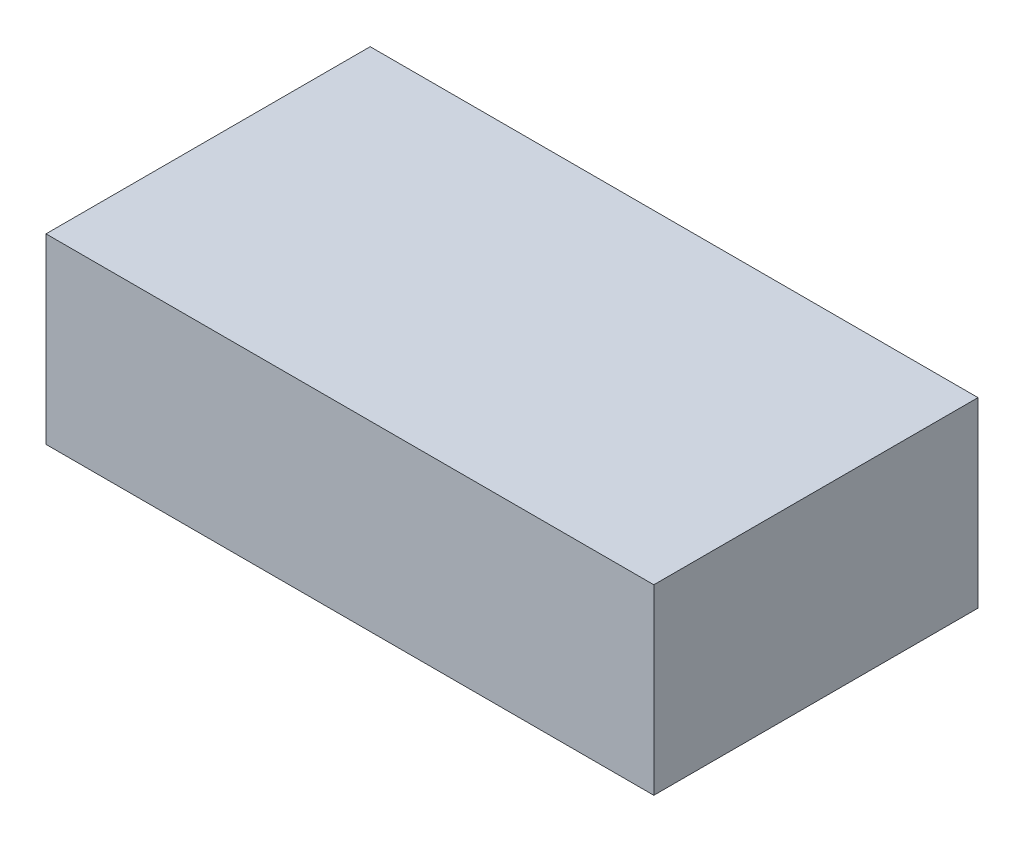
ISO-10303-21;
HEADER;
FILE_DESCRIPTION(('STEP AP214'),'2;1');
FILE_NAME('part.step','',(''),(''),'','','');
FILE_SCHEMA(('AUTOMOTIVE_DESIGN { 1 0 10303 214 1 1 1 1 }'));
ENDSEC;
DATA;
#1=APPLICATION_CONTEXT('core data for automotive mechanical design processes');
#2=APPLICATION_PROTOCOL_DEFINITION('international standard','automotive_design',2000,#1);
#3=PRODUCT_CONTEXT('',#1,'mechanical');
#4=PRODUCT('Part','Part','',(#3));
#5=PRODUCT_RELATED_PRODUCT_CATEGORY('part','',(#4));
#6=PRODUCT_DEFINITION_FORMATION('','',#4);
#7=PRODUCT_DEFINITION_CONTEXT('part definition',#1,'design');
#8=PRODUCT_DEFINITION('design','',#6,#7);
#9=PRODUCT_DEFINITION_SHAPE('','',#8);
#10=(LENGTH_UNIT() NAMED_UNIT(*) SI_UNIT(.MILLI.,.METRE.));
#11=(NAMED_UNIT(*) PLANE_ANGLE_UNIT() SI_UNIT($,.RADIAN.));
#12=(NAMED_UNIT(*) SI_UNIT($,.STERADIAN.) SOLID_ANGLE_UNIT());
#13=UNCERTAINTY_MEASURE_WITH_UNIT(LENGTH_MEASURE(1.E-05),#10,'distance_accuracy_value','');
#14=(GEOMETRIC_REPRESENTATION_CONTEXT(3) GLOBAL_UNCERTAINTY_ASSIGNED_CONTEXT((#13)) GLOBAL_UNIT_ASSIGNED_CONTEXT((#10,
#11,#12)) REPRESENTATION_CONTEXT('',''));
#15=CARTESIAN_POINT('',(0.,0.,0.));
#16=DIRECTION('',(0.,0.,1.));
#17=DIRECTION('',(1.,0.,0.));
#18=AXIS2_PLACEMENT_3D('',#15,#16,#17);
#19=CARTESIAN_POINT('',(75.,45.,-40.));
#20=DIRECTION('',(-1.,0.,0.));
#21=DIRECTION('',(0.,0.,1.));
#22=AXIS2_PLACEMENT_3D('',#19,#20,#21);
#23=PLANE('',#22);
#24=DIRECTION('',(0.,0.,-1.));
#25=VECTOR('',#24,1.);
#26=CARTESIAN_POINT('',(75.,0.,-40.));
#27=LINE('',#26,#25);
#28=CARTESIAN_POINT('',(75.,0.,40.));
#29=VERTEX_POINT('',#28);
#30=CARTESIAN_POINT('',(75.,0.,-40.));
#31=VERTEX_POINT('',#30);
#32=EDGE_CURVE('E97',#29,#31,#27,.T.);
#33=ORIENTED_EDGE('',*,*,#32,.T.);
#34=DIRECTION('',(0.,-1.,0.));
#35=VECTOR('',#34,1.);
#36=CARTESIAN_POINT('',(75.,45.,-40.));
#37=LINE('',#36,#35);
#38=CARTESIAN_POINT('',(75.,45.,-40.));
#39=VERTEX_POINT('',#38);
#40=EDGE_CURVE('E11',#39,#31,#37,.T.);
#41=ORIENTED_EDGE('',*,*,#40,.F.);
#42=DIRECTION('',(0.,0.,-1.));
#43=VECTOR('',#42,1.);
#44=CARTESIAN_POINT('',(75.,45.,-40.));
#45=LINE('',#44,#43);
#46=CARTESIAN_POINT('',(75.,45.,40.));
#47=VERTEX_POINT('',#46);
#48=EDGE_CURVE('E85',#47,#39,#45,.T.);
#49=ORIENTED_EDGE('',*,*,#48,.F.);
#50=DIRECTION('',(0.,-1.,0.));
#51=VECTOR('',#50,1.);
#52=CARTESIAN_POINT('',(75.,45.,40.));
#53=LINE('',#52,#51);
#54=EDGE_CURVE('E93',#47,#29,#53,.T.);
#55=ORIENTED_EDGE('',*,*,#54,.T.);
#56=EDGE_LOOP('',(#33,#41,#49,#55));
#57=FACE_BOUND('',#56,.T.);
#58=ADVANCED_FACE('F34',(#57),#23,.F.);
#59=CARTESIAN_POINT('',(-75.,45.,-40.));
#60=DIRECTION('',(0.,0.,1.));
#61=DIRECTION('',(1.,0.,0.));
#62=AXIS2_PLACEMENT_3D('',#59,#60,#61);
#63=PLANE('',#62);
#64=DIRECTION('',(-1.,0.,0.));
#65=VECTOR('',#64,1.);
#66=CARTESIAN_POINT('',(-75.,0.,-40.));
#67=LINE('',#66,#65);
#68=CARTESIAN_POINT('',(-75.,0.,-40.));
#69=VERTEX_POINT('',#68);
#70=EDGE_CURVE('E89',#31,#69,#67,.T.);
#71=ORIENTED_EDGE('',*,*,#70,.T.);
#72=DIRECTION('',(0.,-1.,0.));
#73=VECTOR('',#72,1.);
#74=CARTESIAN_POINT('',(-75.,45.,-40.));
#75=LINE('',#74,#73);
#76=CARTESIAN_POINT('',(-75.,45.,-40.));
#77=VERTEX_POINT('',#76);
#78=EDGE_CURVE('E42',#77,#69,#75,.T.);
#79=ORIENTED_EDGE('',*,*,#78,.F.);
#80=DIRECTION('',(-1.,0.,0.));
#81=VECTOR('',#80,1.);
#82=CARTESIAN_POINT('',(-75.,45.,-40.));
#83=LINE('',#82,#81);
#84=EDGE_CURVE('E80',#39,#77,#83,.T.);
#85=ORIENTED_EDGE('',*,*,#84,.F.);
#86=ORIENTED_EDGE('',*,*,#40,.T.);
#87=EDGE_LOOP('',(#71,#79,#85,#86));
#88=FACE_BOUND('',#87,.T.);
#89=ADVANCED_FACE('F88',(#88),#63,.F.);
#90=CARTESIAN_POINT('',(-75.,45.,-40.));
#91=DIRECTION('',(1.,0.,0.));
#92=DIRECTION('',(0.,0.,-1.));
#93=AXIS2_PLACEMENT_3D('',#90,#91,#92);
#94=PLANE('',#93);
#95=DIRECTION('',(0.,0.,1.));
#96=VECTOR('',#95,1.);
#97=CARTESIAN_POINT('',(-75.,0.,-40.));
#98=LINE('',#97,#96);
#99=CARTESIAN_POINT('',(-75.,0.,40.));
#100=VERTEX_POINT('',#99);
#101=EDGE_CURVE('E67',#69,#100,#98,.T.);
#102=ORIENTED_EDGE('',*,*,#101,.T.);
#103=DIRECTION('',(0.,-1.,0.));
#104=VECTOR('',#103,1.);
#105=CARTESIAN_POINT('',(-75.,45.,40.));
#106=LINE('',#105,#104);
#107=CARTESIAN_POINT('',(-75.,45.,40.));
#108=VERTEX_POINT('',#107);
#109=EDGE_CURVE('E90',#108,#100,#106,.T.);
#110=ORIENTED_EDGE('',*,*,#109,.F.);
#111=DIRECTION('',(0.,0.,1.));
#112=VECTOR('',#111,1.);
#113=CARTESIAN_POINT('',(-75.,45.,-40.));
#114=LINE('',#113,#112);
#115=EDGE_CURVE('E83',#77,#108,#114,.T.);
#116=ORIENTED_EDGE('',*,*,#115,.F.);
#117=ORIENTED_EDGE('',*,*,#78,.T.);
#118=EDGE_LOOP('',(#102,#110,#116,#117));
#119=FACE_BOUND('',#118,.T.);
#120=ADVANCED_FACE('F91',(#119),#94,.F.);
#121=CARTESIAN_POINT('',(-75.,45.,40.));
#122=DIRECTION('',(0.,0.,-1.));
#123=DIRECTION('',(-1.,0.,0.));
#124=AXIS2_PLACEMENT_3D('',#121,#122,#123);
#125=PLANE('',#124);
#126=DIRECTION('',(1.,0.,0.));
#127=VECTOR('',#126,1.);
#128=CARTESIAN_POINT('',(-75.,0.,40.));
#129=LINE('',#128,#127);
#130=EDGE_CURVE('E73',#100,#29,#129,.T.);
#131=ORIENTED_EDGE('',*,*,#130,.T.);
#132=ORIENTED_EDGE('',*,*,#54,.F.);
#133=DIRECTION('',(1.,0.,0.));
#134=VECTOR('',#133,1.);
#135=CARTESIAN_POINT('',(-75.,45.,40.));
#136=LINE('',#135,#134);
#137=EDGE_CURVE('E50',#108,#47,#136,.T.);
#138=ORIENTED_EDGE('',*,*,#137,.F.);
#139=ORIENTED_EDGE('',*,*,#109,.T.);
#140=EDGE_LOOP('',(#131,#132,#138,#139));
#141=FACE_BOUND('',#140,.T.);
#142=ADVANCED_FACE('F105',(#141),#125,.F.);
#143=CARTESIAN_POINT('',(0.,45.,0.));
#144=DIRECTION('',(0.,1.,0.));
#145=DIRECTION('',(0.,0.,1.));
#146=AXIS2_PLACEMENT_3D('',#143,#144,#145);
#147=PLANE('',#146);
#148=ORIENTED_EDGE('',*,*,#48,.T.);
#149=ORIENTED_EDGE('',*,*,#84,.T.);
#150=ORIENTED_EDGE('',*,*,#115,.T.);
#151=ORIENTED_EDGE('',*,*,#137,.T.);
#152=EDGE_LOOP('',(#148,#149,#150,#151));
#153=FACE_BOUND('',#152,.T.);
#154=ADVANCED_FACE('F81',(#153),#147,.T.);
#155=CARTESIAN_POINT('',(0.,0.,0.));
#156=DIRECTION('',(0.,1.,0.));
#157=DIRECTION('',(0.,0.,1.));
#158=AXIS2_PLACEMENT_3D('',#155,#156,#157);
#159=PLANE('',#158);
#160=CARTESIAN_POINT('',(-38.,0.,0.));
#161=DIRECTION('',(0.,-1.,0.));
#162=DIRECTION('',(0.,0.,1.));
#163=AXIS2_PLACEMENT_3D('',#160,#161,#162);
#164=CIRCLE('',#163,32.5);
#165=CARTESIAN_POINT('',(-38.,0.,32.5));
#166=VERTEX_POINT('',#165);
#167=EDGE_CURVE('E123',#166,#166,#164,.T.);
#168=ORIENTED_EDGE('',*,*,#167,.F.);
#169=EDGE_LOOP('',(#168));
#170=FACE_BOUND('',#169,.T.);
#171=CARTESIAN_POINT('',(38.,0.,0.));
#172=DIRECTION('',(0.,-1.,0.));
#173=DIRECTION('',(0.,0.,-1.));
#174=AXIS2_PLACEMENT_3D('',#171,#172,#173);
#175=CIRCLE('',#174,32.5);
#176=CARTESIAN_POINT('',(38.,0.,-32.5));
#177=VERTEX_POINT('',#176);
#178=EDGE_CURVE('E111',#177,#177,#175,.T.);
#179=ORIENTED_EDGE('',*,*,#178,.F.);
#180=EDGE_LOOP('',(#179));
#181=FACE_BOUND('',#180,.T.);
#182=ORIENTED_EDGE('',*,*,#32,.F.);
#183=ORIENTED_EDGE('',*,*,#130,.F.);
#184=ORIENTED_EDGE('',*,*,#101,.F.);
#185=ORIENTED_EDGE('',*,*,#70,.F.);
#186=EDGE_LOOP('',(#182,#183,#184,#185));
#187=FACE_BOUND('',#186,.T.);
#188=ADVANCED_FACE('F108',(#170,#181,#187),#159,.F.);
#189=CARTESIAN_POINT('',(38.,1.5,0.));
#190=DIRECTION('',(0.,-1.,0.));
#191=DIRECTION('',(0.,0.,-1.));
#192=AXIS2_PLACEMENT_3D('',#189,#190,#191);
#193=CYLINDRICAL_SURFACE('',#192,32.5);
#194=CARTESIAN_POINT('',(38.,1.5,0.));
#195=DIRECTION('',(0.,-1.,0.));
#196=DIRECTION('',(0.,0.,-1.));
#197=AXIS2_PLACEMENT_3D('',#194,#195,#196);
#198=CIRCLE('',#197,32.5);
#199=CARTESIAN_POINT('',(38.,1.5,-32.5));
#200=VERTEX_POINT('',#199);
#201=EDGE_CURVE('E100',#200,#200,#198,.T.);
#202=ORIENTED_EDGE('',*,*,#201,.F.);
#203=EDGE_LOOP('',(#202));
#204=FACE_BOUND('',#203,.T.);
#205=ORIENTED_EDGE('',*,*,#178,.T.);
#206=EDGE_LOOP('',(#205));
#207=FACE_BOUND('',#206,.T.);
#208=ADVANCED_FACE('F153',(#204,#207),#193,.F.);
#209=CARTESIAN_POINT('',(38.,1.5,0.));
#210=DIRECTION('',(0.,-1.,0.));
#211=DIRECTION('',(0.,0.,-1.));
#212=AXIS2_PLACEMENT_3D('',#209,#210,#211);
#213=PLANE('',#212);
#214=CARTESIAN_POINT('',(38.,1.5,0.));
#215=DIRECTION('',(0.,-1.,0.));
#216=DIRECTION('',(0.,0.,-1.));
#217=AXIS2_PLACEMENT_3D('',#214,#215,#216);
#218=CIRCLE('',#217,20.5);
#219=CARTESIAN_POINT('',(38.,1.5,-20.5));
#220=VERTEX_POINT('',#219);
#221=EDGE_CURVE('E114',#220,#220,#218,.T.);
#222=ORIENTED_EDGE('',*,*,#221,.F.);
#223=EDGE_LOOP('',(#222));
#224=FACE_BOUND('',#223,.T.);
#225=ORIENTED_EDGE('',*,*,#201,.T.);
#226=EDGE_LOOP('',(#225));
#227=FACE_BOUND('',#226,.T.);
#228=ADVANCED_FACE('F159',(#224,#227),#213,.T.);
#229=CARTESIAN_POINT('',(38.,1.5,0.));
#230=DIRECTION('',(0.,-1.,0.));
#231=DIRECTION('',(0.,0.,-1.));
#232=AXIS2_PLACEMENT_3D('',#229,#230,#231);
#233=CYLINDRICAL_SURFACE('',#232,20.5);
#234=ORIENTED_EDGE('',*,*,#221,.T.);
#235=EDGE_LOOP('',(#234));
#236=FACE_BOUND('',#235,.T.);
#237=CARTESIAN_POINT('',(38.,0.,0.));
#238=DIRECTION('',(0.,-1.,0.));
#239=DIRECTION('',(0.,0.,-1.));
#240=AXIS2_PLACEMENT_3D('',#237,#238,#239);
#241=CIRCLE('',#240,20.5);
#242=CARTESIAN_POINT('',(38.,0.,-20.5));
#243=VERTEX_POINT('',#242);
#244=EDGE_CURVE('E117',#243,#243,#241,.T.);
#245=ORIENTED_EDGE('',*,*,#244,.F.);
#246=EDGE_LOOP('',(#245));
#247=FACE_BOUND('',#246,.T.);
#248=ADVANCED_FACE('F165',(#236,#247),#233,.T.);
#249=ORIENTED_EDGE('',*,*,#244,.T.);
#250=EDGE_LOOP('',(#249));
#251=FACE_BOUND('',#250,.T.);
#252=ADVANCED_FACE('F147',(#251),#159,.F.);
#253=CARTESIAN_POINT('',(-38.,1.5,0.));
#254=DIRECTION('',(0.,-1.,0.));
#255=DIRECTION('',(0.,0.,-1.));
#256=AXIS2_PLACEMENT_3D('',#253,#254,#255);
#257=CYLINDRICAL_SURFACE('',#256,32.5);
#258=CARTESIAN_POINT('',(-38.,1.5,0.));
#259=DIRECTION('',(0.,-1.,0.));
#260=DIRECTION('',(0.,0.,1.));
#261=AXIS2_PLACEMENT_3D('',#258,#259,#260);
#262=CIRCLE('',#261,32.5);
#263=CARTESIAN_POINT('',(-38.,1.5,32.5));
#264=VERTEX_POINT('',#263);
#265=EDGE_CURVE('E120',#264,#264,#262,.T.);
#266=ORIENTED_EDGE('',*,*,#265,.F.);
#267=EDGE_LOOP('',(#266));
#268=FACE_BOUND('',#267,.T.);
#269=ORIENTED_EDGE('',*,*,#167,.T.);
#270=EDGE_LOOP('',(#269));
#271=FACE_BOUND('',#270,.T.);
#272=ADVANCED_FACE('F141',(#268,#271),#257,.F.);
#273=CARTESIAN_POINT('',(-38.,1.5,0.));
#274=DIRECTION('',(0.,1.,0.));
#275=DIRECTION('',(0.,0.,1.));
#276=AXIS2_PLACEMENT_3D('',#273,#274,#275);
#277=PLANE('',#276);
#278=CARTESIAN_POINT('',(-38.,1.5,0.));
#279=DIRECTION('',(0.,-1.,0.));
#280=DIRECTION('',(0.,0.,1.));
#281=AXIS2_PLACEMENT_3D('',#278,#279,#280);
#282=CIRCLE('',#281,20.5);
#283=CARTESIAN_POINT('',(-38.,1.5,20.5));
#284=VERTEX_POINT('',#283);
#285=EDGE_CURVE('E126',#284,#284,#282,.T.);
#286=ORIENTED_EDGE('',*,*,#285,.F.);
#287=EDGE_LOOP('',(#286));
#288=FACE_BOUND('',#287,.T.);
#289=ORIENTED_EDGE('',*,*,#265,.T.);
#290=EDGE_LOOP('',(#289));
#291=FACE_BOUND('',#290,.T.);
#292=ADVANCED_FACE('F138',(#288,#291),#277,.F.);
#293=CARTESIAN_POINT('',(-38.,1.5,0.));
#294=DIRECTION('',(0.,-1.,0.));
#295=DIRECTION('',(0.,0.,-1.));
#296=AXIS2_PLACEMENT_3D('',#293,#294,#295);
#297=CYLINDRICAL_SURFACE('',#296,20.5);
#298=ORIENTED_EDGE('',*,*,#285,.T.);
#299=EDGE_LOOP('',(#298));
#300=FACE_BOUND('',#299,.T.);
#301=CARTESIAN_POINT('',(-38.,0.,0.));
#302=DIRECTION('',(0.,-1.,0.));
#303=DIRECTION('',(0.,0.,1.));
#304=AXIS2_PLACEMENT_3D('',#301,#302,#303);
#305=CIRCLE('',#304,20.5);
#306=CARTESIAN_POINT('',(-38.,0.,20.5));
#307=VERTEX_POINT('',#306);
#308=EDGE_CURVE('E129',#307,#307,#305,.T.);
#309=ORIENTED_EDGE('',*,*,#308,.F.);
#310=EDGE_LOOP('',(#309));
#311=FACE_BOUND('',#310,.T.);
#312=ADVANCED_FACE('F135',(#300,#311),#297,.T.);
#313=ORIENTED_EDGE('',*,*,#308,.T.);
#314=EDGE_LOOP('',(#313));
#315=FACE_BOUND('',#314,.T.);
#316=ADVANCED_FACE('F155',(#315),#159,.F.);
#317=CLOSED_SHELL('',(#58,#89,#120,#142,#154,#188,#208,#228,#248,#252,#272,#292,#312,#316));
#318=MANIFOLD_SOLID_BREP('B2',#317);
#319=ADVANCED_BREP_SHAPE_REPRESENTATION('',(#18,#318),#14);
#320=SHAPE_DEFINITION_REPRESENTATION(#9,#319);
ENDSEC;
END-ISO-10303-21;
